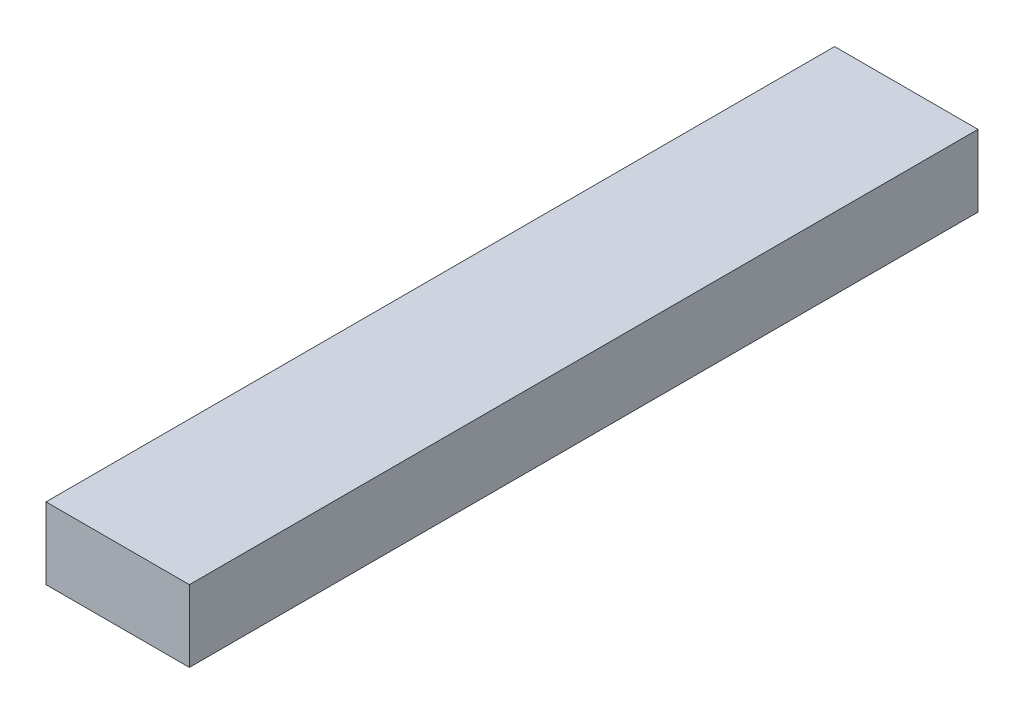
ISO-10303-21;
HEADER;
FILE_DESCRIPTION(('STEP AP214'),'2;1');
FILE_NAME('part.step','',(''),(''),'','','');
FILE_SCHEMA(('AUTOMOTIVE_DESIGN { 1 0 10303 214 1 1 1 1 }'));
ENDSEC;
DATA;
#1=APPLICATION_CONTEXT('core data for automotive mechanical design processes');
#2=APPLICATION_PROTOCOL_DEFINITION('international standard','automotive_design',2000,#1);
#3=PRODUCT_CONTEXT('',#1,'mechanical');
#4=PRODUCT('Part','Part','',(#3));
#5=PRODUCT_RELATED_PRODUCT_CATEGORY('part','',(#4));
#6=PRODUCT_DEFINITION_FORMATION('','',#4);
#7=PRODUCT_DEFINITION_CONTEXT('part definition',#1,'design');
#8=PRODUCT_DEFINITION('design','',#6,#7);
#9=PRODUCT_DEFINITION_SHAPE('','',#8);
#10=(LENGTH_UNIT() NAMED_UNIT(*) SI_UNIT(.MILLI.,.METRE.));
#11=(NAMED_UNIT(*) PLANE_ANGLE_UNIT() SI_UNIT($,.RADIAN.));
#12=(NAMED_UNIT(*) SI_UNIT($,.STERADIAN.) SOLID_ANGLE_UNIT());
#13=UNCERTAINTY_MEASURE_WITH_UNIT(LENGTH_MEASURE(1.E-05),#10,'distance_accuracy_value','');
#14=(GEOMETRIC_REPRESENTATION_CONTEXT(3) GLOBAL_UNCERTAINTY_ASSIGNED_CONTEXT((#13)) GLOBAL_UNIT_ASSIGNED_CONTEXT((#10,
#11,#12)) REPRESENTATION_CONTEXT('',''));
#15=CARTESIAN_POINT('',(0.,0.,0.));
#16=DIRECTION('',(0.,0.,1.));
#17=DIRECTION('',(1.,0.,0.));
#18=AXIS2_PLACEMENT_3D('',#15,#16,#17);
#19=CARTESIAN_POINT('',(-10.,10.,-55.));
#20=DIRECTION('',(1.,0.,0.));
#21=DIRECTION('',(0.,0.,-1.));
#22=AXIS2_PLACEMENT_3D('',#19,#20,#21);
#23=PLANE('',#22);
#24=DIRECTION('',(0.,0.,1.));
#25=VECTOR('',#24,1.);
#26=CARTESIAN_POINT('',(-10.,0.,-55.));
#27=LINE('',#26,#25);
#28=CARTESIAN_POINT('',(-10.,0.,-55.));
#29=VERTEX_POINT('',#28);
#30=CARTESIAN_POINT('',(-10.,0.,55.));
#31=VERTEX_POINT('',#30);
#32=EDGE_CURVE('E95',#29,#31,#27,.T.);
#33=ORIENTED_EDGE('',*,*,#32,.T.);
#34=DIRECTION('',(0.,-1.,0.));
#35=VECTOR('',#34,1.);
#36=CARTESIAN_POINT('',(-10.,10.,55.));
#37=LINE('',#36,#35);
#38=CARTESIAN_POINT('',(-10.,10.,55.));
#39=VERTEX_POINT('',#38);
#40=EDGE_CURVE('E11',#39,#31,#37,.T.);
#41=ORIENTED_EDGE('',*,*,#40,.F.);
#42=DIRECTION('',(0.,0.,1.));
#43=VECTOR('',#42,1.);
#44=CARTESIAN_POINT('',(-10.,10.,-55.));
#45=LINE('',#44,#43);
#46=CARTESIAN_POINT('',(-10.,10.,-55.));
#47=VERTEX_POINT('',#46);
#48=EDGE_CURVE('E83',#47,#39,#45,.T.);
#49=ORIENTED_EDGE('',*,*,#48,.F.);
#50=DIRECTION('',(0.,-1.,0.));
#51=VECTOR('',#50,1.);
#52=CARTESIAN_POINT('',(-10.,10.,-55.));
#53=LINE('',#52,#51);
#54=EDGE_CURVE('E91',#47,#29,#53,.T.);
#55=ORIENTED_EDGE('',*,*,#54,.T.);
#56=EDGE_LOOP('',(#33,#41,#49,#55));
#57=FACE_BOUND('',#56,.T.);
#58=ADVANCED_FACE('F32',(#57),#23,.F.);
#59=CARTESIAN_POINT('',(-10.,10.,55.));
#60=DIRECTION('',(0.,0.,-1.));
#61=DIRECTION('',(-1.,0.,0.));
#62=AXIS2_PLACEMENT_3D('',#59,#60,#61);
#63=PLANE('',#62);
#64=DIRECTION('',(1.,0.,0.));
#65=VECTOR('',#64,1.);
#66=CARTESIAN_POINT('',(-10.,0.,55.));
#67=LINE('',#66,#65);
#68=CARTESIAN_POINT('',(10.,0.,55.));
#69=VERTEX_POINT('',#68);
#70=EDGE_CURVE('E87',#31,#69,#67,.T.);
#71=ORIENTED_EDGE('',*,*,#70,.T.);
#72=DIRECTION('',(0.,-1.,0.));
#73=VECTOR('',#72,1.);
#74=CARTESIAN_POINT('',(10.,10.,55.));
#75=LINE('',#74,#73);
#76=CARTESIAN_POINT('',(10.,10.,55.));
#77=VERTEX_POINT('',#76);
#78=EDGE_CURVE('E40',#77,#69,#75,.T.);
#79=ORIENTED_EDGE('',*,*,#78,.F.);
#80=DIRECTION('',(1.,0.,0.));
#81=VECTOR('',#80,1.);
#82=CARTESIAN_POINT('',(-10.,10.,55.));
#83=LINE('',#82,#81);
#84=EDGE_CURVE('E78',#39,#77,#83,.T.);
#85=ORIENTED_EDGE('',*,*,#84,.F.);
#86=ORIENTED_EDGE('',*,*,#40,.T.);
#87=EDGE_LOOP('',(#71,#79,#85,#86));
#88=FACE_BOUND('',#87,.T.);
#89=ADVANCED_FACE('F86',(#88),#63,.F.);
#90=CARTESIAN_POINT('',(9.99999999999999,10.,-55.));
#91=DIRECTION('',(-1.,0.,0.));
#92=DIRECTION('',(0.,0.,1.));
#93=AXIS2_PLACEMENT_3D('',#90,#91,#92);
#94=PLANE('',#93);
#95=DIRECTION('',(0.,0.,-1.));
#96=VECTOR('',#95,1.);
#97=CARTESIAN_POINT('',(9.99999999999999,0.,-55.));
#98=LINE('',#97,#96);
#99=CARTESIAN_POINT('',(9.99999999999999,0.,-55.));
#100=VERTEX_POINT('',#99);
#101=EDGE_CURVE('E65',#69,#100,#98,.T.);
#102=ORIENTED_EDGE('',*,*,#101,.T.);
#103=DIRECTION('',(0.,-1.,0.));
#104=VECTOR('',#103,1.);
#105=CARTESIAN_POINT('',(9.99999999999999,10.,-55.));
#106=LINE('',#105,#104);
#107=CARTESIAN_POINT('',(9.99999999999999,10.,-55.));
#108=VERTEX_POINT('',#107);
#109=EDGE_CURVE('E88',#108,#100,#106,.T.);
#110=ORIENTED_EDGE('',*,*,#109,.F.);
#111=DIRECTION('',(0.,0.,-1.));
#112=VECTOR('',#111,1.);
#113=CARTESIAN_POINT('',(9.99999999999999,10.,-55.));
#114=LINE('',#113,#112);
#115=EDGE_CURVE('E81',#77,#108,#114,.T.);
#116=ORIENTED_EDGE('',*,*,#115,.F.);
#117=ORIENTED_EDGE('',*,*,#78,.T.);
#118=EDGE_LOOP('',(#102,#110,#116,#117));
#119=FACE_BOUND('',#118,.T.);
#120=ADVANCED_FACE('F89',(#119),#94,.F.);
#121=CARTESIAN_POINT('',(-10.,10.,-55.));
#122=DIRECTION('',(0.,0.,1.));
#123=DIRECTION('',(1.,0.,0.));
#124=AXIS2_PLACEMENT_3D('',#121,#122,#123);
#125=PLANE('',#124);
#126=DIRECTION('',(-1.,0.,0.));
#127=VECTOR('',#126,1.);
#128=CARTESIAN_POINT('',(-10.,0.,-55.));
#129=LINE('',#128,#127);
#130=EDGE_CURVE('E71',#100,#29,#129,.T.);
#131=ORIENTED_EDGE('',*,*,#130,.T.);
#132=ORIENTED_EDGE('',*,*,#54,.F.);
#133=DIRECTION('',(-1.,0.,0.));
#134=VECTOR('',#133,1.);
#135=CARTESIAN_POINT('',(-10.,10.,-55.));
#136=LINE('',#135,#134);
#137=EDGE_CURVE('E48',#108,#47,#136,.T.);
#138=ORIENTED_EDGE('',*,*,#137,.F.);
#139=ORIENTED_EDGE('',*,*,#109,.T.);
#140=EDGE_LOOP('',(#131,#132,#138,#139));
#141=FACE_BOUND('',#140,.T.);
#142=ADVANCED_FACE('F102',(#141),#125,.F.);
#143=CARTESIAN_POINT('',(0.,10.,0.));
#144=DIRECTION('',(0.,1.,0.));
#145=DIRECTION('',(0.,0.,1.));
#146=AXIS2_PLACEMENT_3D('',#143,#144,#145);
#147=PLANE('',#146);
#148=ORIENTED_EDGE('',*,*,#48,.T.);
#149=ORIENTED_EDGE('',*,*,#84,.T.);
#150=ORIENTED_EDGE('',*,*,#115,.T.);
#151=ORIENTED_EDGE('',*,*,#137,.T.);
#152=EDGE_LOOP('',(#148,#149,#150,#151));
#153=FACE_BOUND('',#152,.T.);
#154=ADVANCED_FACE('F79',(#153),#147,.T.);
#155=CARTESIAN_POINT('',(0.,0.,0.));
#156=DIRECTION('',(0.,1.,0.));
#157=DIRECTION('',(0.,0.,1.));
#158=AXIS2_PLACEMENT_3D('',#155,#156,#157);
#159=PLANE('',#158);
#160=ORIENTED_EDGE('',*,*,#32,.F.);
#161=ORIENTED_EDGE('',*,*,#130,.F.);
#162=ORIENTED_EDGE('',*,*,#101,.F.);
#163=ORIENTED_EDGE('',*,*,#70,.F.);
#164=EDGE_LOOP('',(#160,#161,#162,#163));
#165=FACE_BOUND('',#164,.T.);
#166=ADVANCED_FACE('F105',(#165),#159,.F.);
#167=CLOSED_SHELL('',(#58,#89,#120,#142,#154,#166));
#168=MANIFOLD_SOLID_BREP('B2',#167);
#169=ADVANCED_BREP_SHAPE_REPRESENTATION('',(#18,#168),#14);
#170=SHAPE_DEFINITION_REPRESENTATION(#9,#169);
ENDSEC;
END-ISO-10303-21;
